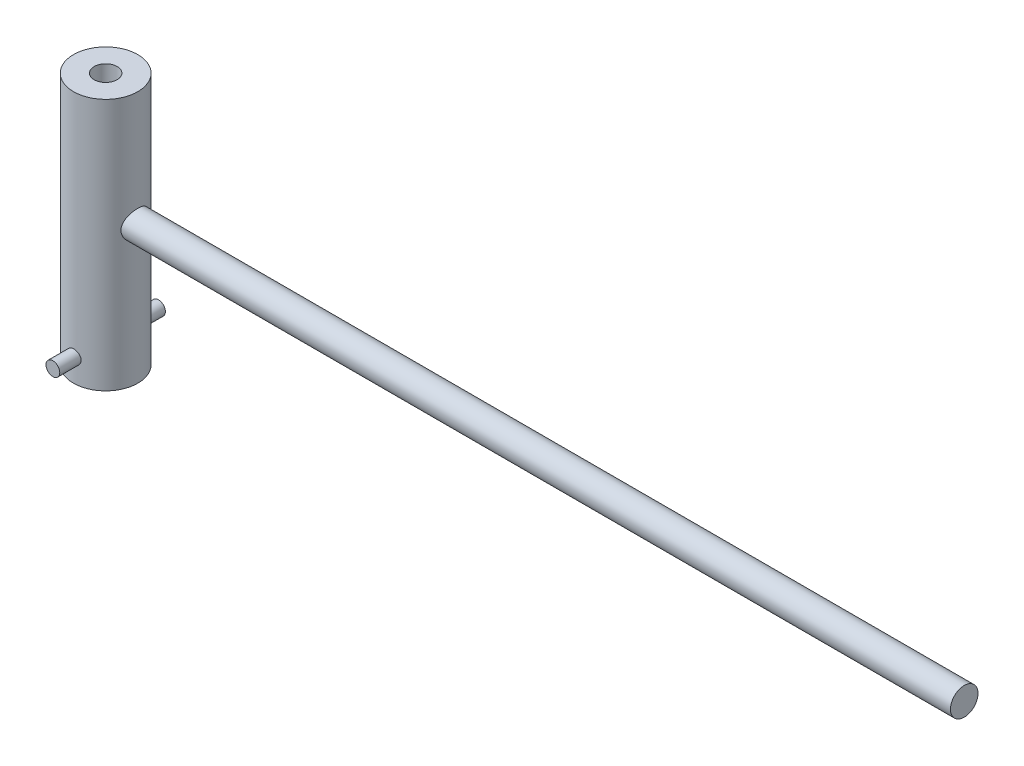
ISO-10303-21;
HEADER;
FILE_DESCRIPTION(('STEP AP214'),'2;1');
FILE_NAME('part.step','',(''),(''),'','','');
FILE_SCHEMA(('AUTOMOTIVE_DESIGN { 1 0 10303 214 1 1 1 1 }'));
ENDSEC;
DATA;
#1=APPLICATION_CONTEXT('core data for automotive mechanical design processes');
#2=APPLICATION_PROTOCOL_DEFINITION('international standard','automotive_design',2000,#1);
#3=PRODUCT_CONTEXT('',#1,'mechanical');
#4=PRODUCT('Part','Part','',(#3));
#5=PRODUCT_RELATED_PRODUCT_CATEGORY('part','',(#4));
#6=PRODUCT_DEFINITION_FORMATION('','',#4);
#7=PRODUCT_DEFINITION_CONTEXT('part definition',#1,'design');
#8=PRODUCT_DEFINITION('design','',#6,#7);
#9=PRODUCT_DEFINITION_SHAPE('','',#8);
#10=(LENGTH_UNIT() NAMED_UNIT(*) SI_UNIT(.MILLI.,.METRE.));
#11=(NAMED_UNIT(*) PLANE_ANGLE_UNIT() SI_UNIT($,.RADIAN.));
#12=(NAMED_UNIT(*) SI_UNIT($,.STERADIAN.) SOLID_ANGLE_UNIT());
#13=UNCERTAINTY_MEASURE_WITH_UNIT(LENGTH_MEASURE(1.E-05),#10,'distance_accuracy_value','');
#14=(GEOMETRIC_REPRESENTATION_CONTEXT(3) GLOBAL_UNCERTAINTY_ASSIGNED_CONTEXT((#13)) GLOBAL_UNIT_ASSIGNED_CONTEXT((#10,
#11,#12)) REPRESENTATION_CONTEXT('',''));
#15=CARTESIAN_POINT('',(0.,0.,0.));
#16=DIRECTION('',(0.,0.,1.));
#17=DIRECTION('',(1.,0.,0.));
#18=AXIS2_PLACEMENT_3D('',#15,#16,#17);
#19=CARTESIAN_POINT('',(-18.3586659492665,-25.,0.));
#20=DIRECTION('',(-1.,0.,0.));
#21=DIRECTION('',(0.,0.,1.));
#22=AXIS2_PLACEMENT_3D('',#19,#20,#21);
#23=CYLINDRICAL_SURFACE('',#22,3.);
#24=CARTESIAN_POINT('',(187.,-25.,0.));
#25=DIRECTION('',(1.,0.,0.));
#26=DIRECTION('',(0.,0.,-1.));
#27=AXIS2_PLACEMENT_3D('',#24,#25,#26);
#28=CIRCLE('',#27,3.);
#29=CARTESIAN_POINT('',(187.,-25.,-3.));
#30=VERTEX_POINT('',#29);
#31=EDGE_CURVE('E46',#30,#30,#28,.T.);
#32=ORIENTED_EDGE('',*,*,#31,.F.);
#33=EDGE_LOOP('',(#32));
#34=FACE_BOUND('',#33,.T.);
#35=CARTESIAN_POINT('',(6.32455532033676,-25.,3.));
#36=CARTESIAN_POINT('',(6.32455623917926,-24.9201992369691,2.99999904512121));
#37=CARTESIAN_POINT('',(6.32607259589376,-24.8403691800294,2.99680914186364));
#38=CARTESIAN_POINT('',(6.33207844610819,-24.6813131090452,2.98409481890062));
#39=CARTESIAN_POINT('',(6.33656983318199,-24.6020875122399,2.97456636476115));
#40=CARTESIAN_POINT('',(6.35433138320313,-24.3659109734567,2.93654933365816));
#41=CARTESIAN_POINT('',(6.3718883479981,-24.2106800341428,2.8986294210123));
#42=CARTESIAN_POINT('',(6.41604959211166,-23.9101296844014,2.79949691759116));
#43=CARTESIAN_POINT('',(6.4426154867075,-23.7647713124138,2.73838302089271));
#44=CARTESIAN_POINT('',(6.50173461776114,-23.4863744560023,2.59488993442855));
#45=CARTESIAN_POINT('',(6.53428667863443,-23.3533335603279,2.51251491871712));
#46=CARTESIAN_POINT('',(6.604111083221,-23.0945471604958,2.32303426891365));
#47=CARTESIAN_POINT('',(6.64154929418065,-22.9697137309487,2.21474428773221));
#48=CARTESIAN_POINT('',(6.71556787556132,-22.7392981429409,1.9789916252315));
#49=CARTESIAN_POINT('',(6.75214789882675,-22.6337236620024,1.85152133453084));
#50=CARTESIAN_POINT('',(6.82236442416005,-22.4400807595414,1.5737748906695));
#51=CARTESIAN_POINT('',(6.85578586283845,-22.3530507479227,1.42271545416052));
#52=CARTESIAN_POINT('',(6.91387422205065,-22.2060358333554,1.10640716164424));
#53=CARTESIAN_POINT('',(6.93854524147057,-22.1460382642549,0.941164994307303));
#54=CARTESIAN_POINT('',(6.9751747106229,-22.0581349636391,0.610764262051987));
#55=CARTESIAN_POINT('',(6.98775448299434,-22.0286539309609,0.446095117735235));
#56=CARTESIAN_POINT('',(7.00104925914407,-21.9975173032829,0.113699399968669));
#57=CARTESIAN_POINT('',(7.00176937203862,-21.995849726301,-0.0540258257506363));
#58=CARTESIAN_POINT('',(6.99162033228838,-22.0195902477911,-0.376268415183325));
#59=CARTESIAN_POINT('',(6.98149359551673,-22.0432637996837,-0.530941438169344));
#60=CARTESIAN_POINT('',(6.95182205628877,-22.1140240689202,-0.833871717827571));
#61=CARTESIAN_POINT('',(6.93227655784003,-22.1611125164986,-0.982128499493934));
#62=CARTESIAN_POINT('',(6.88526693329209,-22.2779065896527,-1.27075797068383));
#63=CARTESIAN_POINT('',(6.85768620781763,-22.3479472923291,-1.41097529460903));
#64=CARTESIAN_POINT('',(6.79727675004242,-22.5083173553763,-1.67803533028446));
#65=CARTESIAN_POINT('',(6.76444613359548,-22.5986540045407,-1.8048732130277));
#66=CARTESIAN_POINT('',(6.69393790301249,-22.804809506676,-2.05154784007322));
#67=CARTESIAN_POINT('',(6.6560813910746,-22.922018869774,-2.1701729768624));
#68=CARTESIAN_POINT('',(6.5815763134261,-23.1747028316495,-2.38662617777592));
#69=CARTESIAN_POINT('',(6.5449282748833,-23.3101852738067,-2.48444526456873));
#70=CARTESIAN_POINT('',(6.47566835431169,-23.6017798744715,-2.65987942757701));
#71=CARTESIAN_POINT('',(6.44325238173047,-23.7584641454813,-2.73662769389096));
#72=CARTESIAN_POINT('',(6.3884939447888,-24.0842890083433,-2.86214771894642));
#73=CARTESIAN_POINT('',(6.36614379619967,-24.253419983258,-2.9109408263676));
#74=CARTESIAN_POINT('',(6.33598550498636,-24.5871727956121,-2.97598670119679));
#75=CARTESIAN_POINT('',(6.32729797712828,-24.7513289806073,-2.99421280080632));
#76=CARTESIAN_POINT('',(6.32292988606606,-25.0805489751083,-3.00343131976711));
#77=CARTESIAN_POINT('',(6.32724437007431,-25.2456124151075,-2.99443410914467));
#78=CARTESIAN_POINT('',(6.34748143158176,-25.5598625737434,-2.9512647841786));
#79=CARTESIAN_POINT('',(6.36257694871081,-25.7093557403718,-2.9188846108295));
#80=CARTESIAN_POINT('',(6.40159573000742,-26.0006454763697,-2.83228012727602));
#81=CARTESIAN_POINT('',(6.42552113853309,-26.1424401665445,-2.77805051059372));
#82=CARTESIAN_POINT('',(6.4807666724858,-26.4212098902911,-2.64668378105435));
#83=CARTESIAN_POINT('',(6.51236308247385,-26.557707321822,-2.56865319415609));
#84=CARTESIAN_POINT('',(6.57901833984006,-26.8163507055113,-2.39277124314047));
#85=CARTESIAN_POINT('',(6.61407874120978,-26.9384901621981,-2.29491096228641));
#86=CARTESIAN_POINT('',(6.68739396565839,-27.1760289255727,-2.07211495440809));
#87=CARTESIAN_POINT('',(6.72566111015056,-27.2899152372238,-1.94556360485738));
#88=CARTESIAN_POINT('',(6.79826947497518,-27.4951342372748,-1.67428466903032));
#89=CARTESIAN_POINT('',(6.83261030191759,-27.5864646667921,-1.5295552644811));
#90=CARTESIAN_POINT('',(6.89381439172467,-27.7440826898071,-1.22458078741679));
#91=CARTESIAN_POINT('',(6.92064008929576,-27.8102450462872,-1.06426298143305));
#92=CARTESIAN_POINT('',(6.96347660484597,-27.9141497981562,-0.733319762769436));
#93=CARTESIAN_POINT('',(6.9794942735468,-27.9519101980084,-0.562700954301774));
#94=CARTESIAN_POINT('',(6.99808081286416,-27.9955774601566,-0.229480384595671));
#95=CARTESIAN_POINT('',(7.00154837158207,-28.0036138205194,-0.0672060876467152));
#96=CARTESIAN_POINT('',(6.99717401704727,-27.9934044812597,0.256339620951762));
#97=CARTESIAN_POINT('',(6.98933429595527,-27.975163875996,0.417611220908518));
#98=CARTESIAN_POINT('',(6.96371224258032,-27.9144464958275,0.728044798339692));
#99=CARTESIAN_POINT('',(6.94633102658131,-27.8729461526345,0.877433690400417));
#100=CARTESIAN_POINT('',(6.90358200259661,-27.7679838160802,1.16704890744754));
#101=CARTESIAN_POINT('',(6.87821272472254,-27.7045177805843,1.30727354037359));
#102=CARTESIAN_POINT('',(6.82048100144583,-27.554210112164,1.58164154030708));
#103=CARTESIAN_POINT('',(6.78785230171247,-27.4664340781465,1.71521554911027));
#104=CARTESIAN_POINT('',(6.71941601876115,-27.2713182864619,1.96631980223031));
#105=CARTESIAN_POINT('',(6.68360718068102,-27.1639707882705,2.08384366642575));
#106=CARTESIAN_POINT('',(6.60956029826529,-26.9236161365569,2.30839582375667));
#107=CARTESIAN_POINT('',(6.57133471854879,-26.789311585381,2.41404185093547));
#108=CARTESIAN_POINT('',(6.49938146624856,-26.5036538672722,2.60157161791913));
#109=CARTESIAN_POINT('',(6.46565641748318,-26.3522908492402,2.68344152863089));
#110=CARTESIAN_POINT('',(6.42172587804179,-26.1156175589237,2.78618250414778));
#111=CARTESIAN_POINT('',(6.40819457191418,-26.035144240841,2.81707998873811));
#112=CARTESIAN_POINT('',(6.38380411418014,-25.8714837771679,2.87192428390112));
#113=CARTESIAN_POINT('',(6.37294364206055,-25.7882979958088,2.89587453038153));
#114=CARTESIAN_POINT('',(6.35433014729515,-25.6200691923187,2.93649221837599));
#115=CARTESIAN_POINT('',(6.34656894419171,-25.535031692618,2.95317884271359));
#116=CARTESIAN_POINT('',(6.33442493706763,-25.3636372282871,2.97913893233313));
#117=CARTESIAN_POINT('',(6.33003954418515,-25.2772813266588,2.98841807850959));
#118=CARTESIAN_POINT('',(6.32647229512563,-25.1589385998236,2.99595579124565));
#119=CARTESIAN_POINT('',(6.32575401974705,-25.1271757192401,2.99747183035651));
#120=CARTESIAN_POINT('',(6.3247953454093,-25.0636101108314,2.99949413311608));
#121=CARTESIAN_POINT('',(6.32455495409998,-25.0318073823767,3.0000003806003));
#122=CARTESIAN_POINT('',(6.32455532033676,-25.,3.));
#123=B_SPLINE_CURVE_WITH_KNOTS('',3,(#35,#36,#37,#38,#39,#40,#41,#42,#43,#44,#45,#46,#47,#48,
#49,#50,#51,#52,#53,#54,#55,#56,#57,#58,#59,#60,#61,#62,#63,#64,#65,#66,#67,#68,#69,#70,#71,#72,
#73,#74,#75,#76,#77,#78,#79,#80,#81,#82,#83,#84,#85,#86,#87,#88,#89,#90,#91,#92,#93,#94,#95,#96,
#97,#98,#99,#100,#101,#102,#103,#104,#105,#106,#107,#108,#109,#110,#111,#112,#113,#114,#115,
#116,#117,#118,#119,#120,#121,#122),.UNSPECIFIED.,.T.,.F.,(4,2,2,2,2,2,2,2,2,2,2,2,2,2,2,2,2,2,
2,2,2,2,2,2,2,2,2,2,2,2,2,2,2,2,2,2,2,2,2,2,2,2,2,4),(0.,0.239366653231037,0.478885807272615,
0.95857439912593,1.43624431857919,1.91382053150697,2.41995684393642,2.92629448725105,
3.45610451675015,3.98566604296333,4.48627308722846,4.98666446539178,5.45487182502103,
5.92311378779297,6.39852111765621,6.87409945213909,7.38485137094337,7.89582322238326,
8.42542768080316,8.95462715213609,9.44812252419891,9.94142993544505,10.4004743903489,
10.8596303986217,11.3387499488479,11.8180854227975,12.3391595177845,12.8602857751477,
13.3839722669446,13.9073265049035,14.3923682623503,14.8773159966024,15.3432850585276,
15.8093399138768,16.2966585998759,16.7841704404229,17.3070906286303,17.8303143607245,
18.0917878499581,18.3531318004373,18.6137813055802,18.8742307225592,18.9696371385413,
19.0650450817536),.UNSPECIFIED.);
#124=CARTESIAN_POINT('',(6.32455532033676,-25.,3.));
#125=VERTEX_POINT('',#124);
#126=EDGE_CURVE('E10',#125,#125,#123,.T.);
#127=ORIENTED_EDGE('',*,*,#126,.F.);
#128=EDGE_LOOP('',(#127));
#129=FACE_BOUND('',#128,.T.);
#130=ADVANCED_FACE('F35',(#34,#129),#23,.T.);
#131=CARTESIAN_POINT('',(187.,-25.,0.));
#132=DIRECTION('',(1.,0.,0.));
#133=DIRECTION('',(0.,0.,-1.));
#134=AXIS2_PLACEMENT_3D('',#131,#132,#133);
#135=PLANE('',#134);
#136=ORIENTED_EDGE('',*,*,#31,.T.);
#137=EDGE_LOOP('',(#136));
#138=FACE_BOUND('',#137,.T.);
#139=ADVANCED_FACE('F70',(#138),#135,.T.);
#140=CARTESIAN_POINT('',(0.,0.,0.));
#141=DIRECTION('',(0.,1.,0.));
#142=DIRECTION('',(0.,0.,1.));
#143=AXIS2_PLACEMENT_3D('',#140,#141,#142);
#144=CYLINDRICAL_SURFACE('',#143,7.);
#145=CARTESIAN_POINT('',(1.5,-50.,6.83739716558868));
#146=CARTESIAN_POINT('',(1.49999708238613,-50.083211152482,6.83739884558951));
#147=CARTESIAN_POINT('',(1.49305236244768,-50.1664577739421,6.83893272341929));
#148=CARTESIAN_POINT('',(1.46548559252999,-50.330586672242,6.84489178429867));
#149=CARTESIAN_POINT('',(1.44485339653622,-50.4114671486762,6.84931911211842));
#150=CARTESIAN_POINT('',(1.39058863684599,-50.5684657495742,6.86054115293409));
#151=CARTESIAN_POINT('',(1.35697000991314,-50.6445888781215,6.86733332725825));
#152=CARTESIAN_POINT('',(1.27772617673341,-50.7901152739446,6.88251670848645));
#153=CARTESIAN_POINT('',(1.23210132048776,-50.8595187370291,6.89090786877545));
#154=CARTESIAN_POINT('',(1.12935142570221,-50.9907629614821,6.90849578796654));
#155=CARTESIAN_POINT('',(1.07206859483983,-51.05247887624,6.91770249871754));
#156=CARTESIAN_POINT('',(0.947969508129578,-51.1655035544058,6.93579691710397));
#157=CARTESIAN_POINT('',(0.881152530217677,-51.2168115288601,6.94468460051417));
#158=CARTESIAN_POINT('',(0.739047288464582,-51.3080554444914,6.96124769109432));
#159=CARTESIAN_POINT('',(0.663680488229954,-51.3478716557706,6.9689099881943));
#160=CARTESIAN_POINT('',(0.507134269342595,-51.4142276914463,6.98204671042934));
#161=CARTESIAN_POINT('',(0.425955477380312,-51.4407689447863,6.98752137103329));
#162=CARTESIAN_POINT('',(0.261387187671511,-51.4794299709313,6.99559565281181));
#163=CARTESIAN_POINT('',(0.178049400596923,-51.4917609285524,6.99823733378385));
#164=CARTESIAN_POINT('',(0.0104489453066432,-51.5023112773133,7.00049362207002));
#165=CARTESIAN_POINT('',(-0.0738136201647616,-51.5005322205608,7.00010856232699));
#166=CARTESIAN_POINT('',(-0.239417029250515,-51.4830710353364,6.99638700862558));
#167=CARTESIAN_POINT('',(-0.320783115362116,-51.4676164997101,6.99309883152432));
#168=CARTESIAN_POINT('',(-0.479739463978393,-51.4236053181481,6.98399541589105));
#169=CARTESIAN_POINT('',(-0.557329560175058,-51.3950480957003,6.97818006616519));
#170=CARTESIAN_POINT('',(-0.707167497556556,-51.3254385411115,6.96459754646858));
#171=CARTESIAN_POINT('',(-0.779373657015791,-51.2842992327957,6.95681685803946));
#172=CARTESIAN_POINT('',(-0.915940926562849,-51.1907580318364,6.94015793743865));
#173=CARTESIAN_POINT('',(-0.980301006451532,-51.1383546626997,6.93127956144694));
#174=CARTESIAN_POINT('',(-1.10070208800198,-51.0225314554721,6.91319326460925));
#175=CARTESIAN_POINT('',(-1.15655117320251,-50.958912420643,6.90398230372853));
#176=CARTESIAN_POINT('',(-1.25682243234728,-50.8231167149315,6.88643566831974));
#177=CARTESIAN_POINT('',(-1.30124432118069,-50.7509398305947,6.87810001563387));
#178=CARTESIAN_POINT('',(-1.37748077573297,-50.5997754989362,6.86324023586723));
#179=CARTESIAN_POINT('',(-1.40926035088923,-50.5207698761476,6.85672115127776));
#180=CARTESIAN_POINT('',(-1.45903495159116,-50.3583672340536,6.84630340806617));
#181=CARTESIAN_POINT('',(-1.47703206694628,-50.2749708825568,6.84240435218483));
#182=CARTESIAN_POINT('',(-1.49843586024652,-50.1079042473503,6.83774881255446));
#183=CARTESIAN_POINT('',(-1.5021214192864,-50.0242713249227,6.83693227051702));
#184=CARTESIAN_POINT('',(-1.49555139642374,-49.8575860068183,6.83837239573994));
#185=CARTESIAN_POINT('',(-1.48529673081635,-49.7745335733465,6.84062886101063));
#186=CARTESIAN_POINT('',(-1.45137894635584,-49.6123295650192,6.84790415484206));
#187=CARTESIAN_POINT('',(-1.42786830251554,-49.533144567403,6.85289155274364));
#188=CARTESIAN_POINT('',(-1.3682705294675,-49.3798376624671,6.86503859869777));
#189=CARTESIAN_POINT('',(-1.33218223662818,-49.3057162243658,6.87219844772849));
#190=CARTESIAN_POINT('',(-1.24783504416705,-49.1634303152411,6.88801634080346));
#191=CARTESIAN_POINT('',(-1.19940368590792,-49.0953704179878,6.89669501746317));
#192=CARTESIAN_POINT('',(-1.09197183833601,-48.9682416541262,6.91451775360139));
#193=CARTESIAN_POINT('',(-1.03297009182161,-48.9091738585515,6.92366186834462));
#194=CARTESIAN_POINT('',(-0.904812764420812,-48.8006296970552,6.94158239990174));
#195=CARTESIAN_POINT('',(-0.835494925828768,-48.751343083843,6.95034935607746));
#196=CARTESIAN_POINT('',(-0.689401481282273,-48.6651145906489,6.96635610714902));
#197=CARTESIAN_POINT('',(-0.612626216043736,-48.6281721470272,6.97359597176693));
#198=CARTESIAN_POINT('',(-0.454265418982036,-48.5679479453615,6.98569278381575));
#199=CARTESIAN_POINT('',(-0.372713193075168,-48.5445816962537,6.99056443803698));
#200=CARTESIAN_POINT('',(-0.206725177003286,-48.5119082942677,6.99743939301981));
#201=CARTESIAN_POINT('',(-0.12228978997399,-48.5025991840261,6.99944309312296));
#202=CARTESIAN_POINT('',(0.0452637170528315,-48.4983893475881,7.00034511009057));
#203=CARTESIAN_POINT('',(0.128374505509232,-48.5032048413954,6.99930459001668));
#204=CARTESIAN_POINT('',(0.292572938415963,-48.526474763519,6.99436552363383));
#205=CARTESIAN_POINT('',(0.373660616405288,-48.5449289655783,6.99046702473686));
#206=CARTESIAN_POINT('',(0.531301948487273,-48.5948188062495,6.98025388638537));
#207=CARTESIAN_POINT('',(0.607868365073182,-48.6262156893856,6.97394646430493));
#208=CARTESIAN_POINT('',(0.754684956723224,-48.7010612711691,6.95959036050661));
#209=CARTESIAN_POINT('',(0.824934544796144,-48.744511088306,6.95154151720341));
#210=CARTESIAN_POINT('',(0.958512306895247,-48.8431623187427,6.93439809934494));
#211=CARTESIAN_POINT('',(1.02169036510578,-48.8985641583213,6.92528708907874));
#212=CARTESIAN_POINT('',(1.13795001457643,-49.0191406102504,6.90713690075836));
#213=CARTESIAN_POINT('',(1.19102918062422,-49.0843175633556,6.89809774045682));
#214=CARTESIAN_POINT('',(1.28623261596675,-49.2235904931857,6.88098693651916));
#215=CARTESIAN_POINT('',(1.32820897809617,-49.297789358287,6.87292905956534));
#216=CARTESIAN_POINT('',(1.39903004659825,-49.4523437209233,6.85886497228049));
#217=CARTESIAN_POINT('',(1.42788606423931,-49.5326938452531,6.85285699581573));
#218=CARTESIAN_POINT('',(1.46638607121558,-49.6776261311859,6.84470560641997));
#219=CARTESIAN_POINT('',(1.47896752507744,-49.7414116757078,6.84198283087953));
#220=CARTESIAN_POINT('',(1.49577544043437,-49.8701243115773,6.83832799504406));
#221=CARTESIAN_POINT('',(1.50000227727981,-49.9350513515083,6.8373958543007));
#222=CARTESIAN_POINT('',(1.5,-50.,6.83739716558868));
#223=B_SPLINE_CURVE_WITH_KNOTS('',3,(#145,#146,#147,#148,#149,#150,#151,#152,#153,#154,#155,
#156,#157,#158,#159,#160,#161,#162,#163,#164,#165,#166,#167,#168,#169,#170,#171,#172,#173,#174,
#175,#176,#177,#178,#179,#180,#181,#182,#183,#184,#185,#186,#187,#188,#189,#190,#191,#192,#193,
#194,#195,#196,#197,#198,#199,#200,#201,#202,#203,#204,#205,#206,#207,#208,#209,#210,#211,#212,
#213,#214,#215,#216,#217,#218,#219,#220,#221,#222),.UNSPECIFIED.,.T.,.F.,(4,2,2,2,2,2,2,2,2,2,2,
2,2,2,2,2,2,2,2,2,2,2,2,2,2,2,2,2,2,2,2,2,2,2,2,2,2,2,4),(0.,0.249395482027527,
0.498976038479968,0.748289491152764,0.997595676735284,1.25053229582692,1.50348808112879,
1.75899134820279,2.01446710646268,2.26609508151929,2.51769537777242,2.76518557667372,
3.01268666607584,3.26193888143438,3.51122378872316,3.76548960779296,4.01976177023093,
4.27473287411782,4.52966530953839,4.77960433192523,5.02952692653917,5.27663180749375,
5.52375955563151,5.77455010216318,6.02537049659079,6.28066214683211,6.53594213875543,
6.78961589824377,7.0432543320854,7.29183199644128,7.54040553715101,7.78824009619485,
8.03609766151367,8.28848914160966,8.54094115631234,8.7966038016725,9.05204561611689,
9.24671456122273,9.44137476018023),.UNSPECIFIED.);
#224=CARTESIAN_POINT('',(1.5,-50.,6.83739716558868));
#225=VERTEX_POINT('',#224);
#226=EDGE_CURVE('E50',#225,#225,#223,.T.);
#227=ORIENTED_EDGE('',*,*,#226,.T.);
#228=EDGE_LOOP('',(#227));
#229=FACE_BOUND('',#228,.T.);
#230=CARTESIAN_POINT('',(0.,-55.,0.));
#231=DIRECTION('',(0.,1.,0.));
#232=DIRECTION('',(0.,0.,1.));
#233=AXIS2_PLACEMENT_3D('',#230,#231,#232);
#234=CIRCLE('',#233,7.00000000000001);
#235=CARTESIAN_POINT('',(0.,-55.,7.00000000000001));
#236=VERTEX_POINT('',#235);
#237=EDGE_CURVE('E191',#236,#236,#234,.T.);
#238=ORIENTED_EDGE('',*,*,#237,.T.);
#239=EDGE_LOOP('',(#238));
#240=FACE_BOUND('',#239,.T.);
#241=CARTESIAN_POINT('',(0.,0.,0.));
#242=DIRECTION('',(0.,1.,0.));
#243=DIRECTION('',(0.,0.,1.));
#244=AXIS2_PLACEMENT_3D('',#241,#242,#243);
#245=CIRCLE('',#244,7.);
#246=CARTESIAN_POINT('',(0.,0.,7.));
#247=VERTEX_POINT('',#246);
#248=EDGE_CURVE('E193',#247,#247,#245,.T.);
#249=ORIENTED_EDGE('',*,*,#248,.F.);
#250=EDGE_LOOP('',(#249));
#251=FACE_BOUND('',#250,.T.);
#252=CARTESIAN_POINT('',(-1.5,-50.,-6.83739716558868));
#253=CARTESIAN_POINT('',(-1.49999708238613,-50.0832111524819,-6.83739884558951));
#254=CARTESIAN_POINT('',(-1.49305236244768,-50.1664577739421,-6.83893272341929));
#255=CARTESIAN_POINT('',(-1.46548559253,-50.330586672242,-6.84489178429867));
#256=CARTESIAN_POINT('',(-1.44485339653622,-50.4114671486762,-6.84931911211842));
#257=CARTESIAN_POINT('',(-1.390588636846,-50.5684657495742,-6.86054115293409));
#258=CARTESIAN_POINT('',(-1.35697000991315,-50.6445888781215,-6.86733332725825));
#259=CARTESIAN_POINT('',(-1.27772617673341,-50.7901152739446,-6.88251670848644));
#260=CARTESIAN_POINT('',(-1.23210132048776,-50.8595187370291,-6.89090786877545));
#261=CARTESIAN_POINT('',(-1.12935142570221,-50.9907629614821,-6.90849578796654));
#262=CARTESIAN_POINT('',(-1.07206859483983,-51.05247887624,-6.91770249871754));
#263=CARTESIAN_POINT('',(-0.94796950812958,-51.1655035544058,-6.93579691710397));
#264=CARTESIAN_POINT('',(-0.881152530217679,-51.2168115288601,-6.94468460051417));
#265=CARTESIAN_POINT('',(-0.739047288464585,-51.3080554444914,-6.96124769109432));
#266=CARTESIAN_POINT('',(-0.663680488229956,-51.3478716557706,-6.9689099881943));
#267=CARTESIAN_POINT('',(-0.507134269342598,-51.4142276914463,-6.98204671042934));
#268=CARTESIAN_POINT('',(-0.425955477380316,-51.4407689447863,-6.98752137103329));
#269=CARTESIAN_POINT('',(-0.261387187671517,-51.4794299709313,-6.99559565281181));
#270=CARTESIAN_POINT('',(-0.178049400596928,-51.4917609285524,-6.99823733378385));
#271=CARTESIAN_POINT('',(-0.0104489453066492,-51.5023112773133,-7.00049362207002));
#272=CARTESIAN_POINT('',(0.073813620164755,-51.5005322205608,-7.00010856232699));
#273=CARTESIAN_POINT('',(0.239417029250508,-51.4830710353364,-6.99638700862558));
#274=CARTESIAN_POINT('',(0.32078311536211,-51.4676164997101,-6.99309883152432));
#275=CARTESIAN_POINT('',(0.479739463978386,-51.4236053181481,-6.98399541589105));
#276=CARTESIAN_POINT('',(0.557329560175051,-51.3950480957003,-6.97818006616519));
#277=CARTESIAN_POINT('',(0.707167497556549,-51.3254385411115,-6.96459754646858));
#278=CARTESIAN_POINT('',(0.779373657015785,-51.2842992327957,-6.95681685803946));
#279=CARTESIAN_POINT('',(0.915940926562842,-51.1907580318364,-6.94015793743865));
#280=CARTESIAN_POINT('',(0.980301006451525,-51.1383546626997,-6.93127956144694));
#281=CARTESIAN_POINT('',(1.10070208800198,-51.0225314554721,-6.91319326460925));
#282=CARTESIAN_POINT('',(1.1565511732025,-50.958912420643,-6.90398230372853));
#283=CARTESIAN_POINT('',(1.25682243234728,-50.8231167149315,-6.88643566831975));
#284=CARTESIAN_POINT('',(1.30124432118068,-50.7509398305948,-6.87810001563387));
#285=CARTESIAN_POINT('',(1.37748077573296,-50.5997754989362,-6.86324023586723));
#286=CARTESIAN_POINT('',(1.40926035088922,-50.5207698761476,-6.85672115127776));
#287=CARTESIAN_POINT('',(1.45903495159115,-50.3583672340536,-6.84630340806617));
#288=CARTESIAN_POINT('',(1.47703206694628,-50.2749708825568,-6.84240435218483));
#289=CARTESIAN_POINT('',(1.49843586024652,-50.1079042473503,-6.83774881255446));
#290=CARTESIAN_POINT('',(1.5021214192864,-50.0242713249227,-6.83693227051702));
#291=CARTESIAN_POINT('',(1.49555139642373,-49.8575860068183,-6.83837239573994));
#292=CARTESIAN_POINT('',(1.48529673081635,-49.7745335733465,-6.84062886101063));
#293=CARTESIAN_POINT('',(1.45137894635584,-49.6123295650192,-6.84790415484206));
#294=CARTESIAN_POINT('',(1.42786830251553,-49.533144567403,-6.85289155274364));
#295=CARTESIAN_POINT('',(1.3682705294675,-49.3798376624671,-6.86503859869777));
#296=CARTESIAN_POINT('',(1.33218223662818,-49.3057162243658,-6.87219844772849));
#297=CARTESIAN_POINT('',(1.24783504416705,-49.1634303152411,-6.88801634080346));
#298=CARTESIAN_POINT('',(1.19940368590792,-49.0953704179878,-6.89669501746317));
#299=CARTESIAN_POINT('',(1.09197183833601,-48.9682416541262,-6.91451775360139));
#300=CARTESIAN_POINT('',(1.03297009182161,-48.9091738585515,-6.92366186834462));
#301=CARTESIAN_POINT('',(0.904812764420818,-48.8006296970552,-6.94158239990174));
#302=CARTESIAN_POINT('',(0.835494925828774,-48.751343083843,-6.95034935607746));
#303=CARTESIAN_POINT('',(0.68940148128228,-48.665114590649,-6.96635610714901));
#304=CARTESIAN_POINT('',(0.612626216043743,-48.6281721470272,-6.97359597176692));
#305=CARTESIAN_POINT('',(0.454265418982044,-48.5679479453615,-6.98569278381575));
#306=CARTESIAN_POINT('',(0.372713193075176,-48.5445816962537,-6.99056443803698));
#307=CARTESIAN_POINT('',(0.206725177003294,-48.5119082942677,-6.99743939301981));
#308=CARTESIAN_POINT('',(0.122289789973998,-48.5025991840261,-6.99944309312296));
#309=CARTESIAN_POINT('',(-0.0452637170528241,-48.4983893475882,-7.00034511009057));
#310=CARTESIAN_POINT('',(-0.128374505509225,-48.5032048413954,-6.99930459001668));
#311=CARTESIAN_POINT('',(-0.292572938415957,-48.526474763519,-6.99436552363383));
#312=CARTESIAN_POINT('',(-0.373660616405281,-48.5449289655783,-6.99046702473686));
#313=CARTESIAN_POINT('',(-0.531301948487266,-48.5948188062495,-6.98025388638537));
#314=CARTESIAN_POINT('',(-0.607868365073175,-48.6262156893856,-6.97394646430493));
#315=CARTESIAN_POINT('',(-0.754684956723219,-48.7010612711691,-6.95959036050661));
#316=CARTESIAN_POINT('',(-0.824934544796139,-48.744511088306,-6.95154151720341));
#317=CARTESIAN_POINT('',(-0.958512306895243,-48.8431623187427,-6.93439809934494));
#318=CARTESIAN_POINT('',(-1.02169036510578,-48.8985641583213,-6.92528708907874));
#319=CARTESIAN_POINT('',(-1.13795001457643,-49.0191406102504,-6.90713690075837));
#320=CARTESIAN_POINT('',(-1.19102918062422,-49.0843175633556,-6.89809774045682));
#321=CARTESIAN_POINT('',(-1.28623261596675,-49.2235904931857,-6.88098693651916));
#322=CARTESIAN_POINT('',(-1.32820897809616,-49.297789358287,-6.87292905956534));
#323=CARTESIAN_POINT('',(-1.39903004659825,-49.4523437209233,-6.85886497228049));
#324=CARTESIAN_POINT('',(-1.4278860642393,-49.5326938452531,-6.85285699581573));
#325=CARTESIAN_POINT('',(-1.46638607121557,-49.6776261311859,-6.84470560641997));
#326=CARTESIAN_POINT('',(-1.47896752507743,-49.7414116757078,-6.84198283087953));
#327=CARTESIAN_POINT('',(-1.49577544043437,-49.8701243115773,-6.83832799504406));
#328=CARTESIAN_POINT('',(-1.50000227727981,-49.9350513515083,-6.8373958543007));
#329=CARTESIAN_POINT('',(-1.5,-50.,-6.83739716558868));
#330=B_SPLINE_CURVE_WITH_KNOTS('',3,(#252,#253,#254,#255,#256,#257,#258,#259,#260,#261,#262,
#263,#264,#265,#266,#267,#268,#269,#270,#271,#272,#273,#274,#275,#276,#277,#278,#279,#280,#281,
#282,#283,#284,#285,#286,#287,#288,#289,#290,#291,#292,#293,#294,#295,#296,#297,#298,#299,#300,
#301,#302,#303,#304,#305,#306,#307,#308,#309,#310,#311,#312,#313,#314,#315,#316,#317,#318,#319,
#320,#321,#322,#323,#324,#325,#326,#327,#328,#329),.UNSPECIFIED.,.T.,.F.,(4,2,2,2,2,2,2,2,2,2,2,
2,2,2,2,2,2,2,2,2,2,2,2,2,2,2,2,2,2,2,2,2,2,2,2,2,2,2,4),(0.,0.249395482027513,0.49897603847996,
0.748289491152749,0.997595676735275,1.25053229582692,1.50348808112878,1.75899134820278,
2.01446710646267,2.26609508151928,2.5176953777724,2.76518557667371,3.01268666607583,
3.26193888143437,3.51122378872314,3.76548960779295,4.01976177023092,4.2747328741178,
4.52966530953838,4.77960433192523,5.02952692653917,5.27663180749374,5.52375955563149,
5.77455010216318,6.02537049659078,6.2806621468321,6.53594213875541,6.78961589824375,
7.04325433208538,7.29183199644126,7.54040553715099,7.78824009619483,8.03609766151365,
8.28848914160965,8.54094115631232,8.79660380167249,9.05204561611687,9.24671456122271,
9.44137476018022),.UNSPECIFIED.);
#331=CARTESIAN_POINT('',(-1.5,-50.,-6.83739716558868));
#332=VERTEX_POINT('',#331);
#333=EDGE_CURVE('E78',#332,#332,#330,.T.);
#334=ORIENTED_EDGE('',*,*,#333,.T.);
#335=EDGE_LOOP('',(#334));
#336=FACE_BOUND('',#335,.T.);
#337=ORIENTED_EDGE('',*,*,#126,.T.);
#338=EDGE_LOOP('',(#337));
#339=FACE_BOUND('',#338,.T.);
#340=ADVANCED_FACE('F65',(#229,#240,#251,#336,#339),#144,.T.);
#341=CARTESIAN_POINT('',(0.,-50.,15.1195553164222));
#342=DIRECTION('',(0.,0.,1.));
#343=DIRECTION('',(1.,0.,0.));
#344=AXIS2_PLACEMENT_3D('',#341,#342,#343);
#345=CYLINDRICAL_SURFACE('',#344,1.5);
#346=CARTESIAN_POINT('',(0.,-50.,11.5));
#347=DIRECTION('',(0.,0.,1.));
#348=DIRECTION('',(1.,0.,0.));
#349=AXIS2_PLACEMENT_3D('',#346,#347,#348);
#350=CIRCLE('',#349,1.5);
#351=CARTESIAN_POINT('',(1.5,-50.,11.5));
#352=VERTEX_POINT('',#351);
#353=EDGE_CURVE('E54',#352,#352,#350,.T.);
#354=ORIENTED_EDGE('',*,*,#353,.F.);
#355=EDGE_LOOP('',(#354));
#356=FACE_BOUND('',#355,.T.);
#357=ORIENTED_EDGE('',*,*,#226,.F.);
#358=EDGE_LOOP('',(#357));
#359=FACE_BOUND('',#358,.T.);
#360=ADVANCED_FACE('F62',(#356,#359),#345,.T.);
#361=CARTESIAN_POINT('',(0.,-50.,11.5));
#362=DIRECTION('',(0.,0.,1.));
#363=DIRECTION('',(1.,0.,0.));
#364=AXIS2_PLACEMENT_3D('',#361,#362,#363);
#365=PLANE('',#364);
#366=ORIENTED_EDGE('',*,*,#353,.T.);
#367=EDGE_LOOP('',(#366));
#368=FACE_BOUND('',#367,.T.);
#369=ADVANCED_FACE('F130',(#368),#365,.T.);
#370=CARTESIAN_POINT('',(0.,0.,0.));
#371=DIRECTION('',(0.,-1.,0.));
#372=DIRECTION('',(0.,0.,-1.));
#373=AXIS2_PLACEMENT_3D('',#370,#371,#372);
#374=PLANE('',#373);
#375=CARTESIAN_POINT('',(0.,0.,0.));
#376=DIRECTION('',(0.,1.,0.));
#377=DIRECTION('',(0.,0.,1.));
#378=AXIS2_PLACEMENT_3D('',#375,#376,#377);
#379=CIRCLE('',#378,2.5);
#380=CARTESIAN_POINT('',(0.,0.,2.5));
#381=VERTEX_POINT('',#380);
#382=EDGE_CURVE('E86',#381,#381,#379,.T.);
#383=ORIENTED_EDGE('',*,*,#382,.F.);
#384=EDGE_LOOP('',(#383));
#385=FACE_BOUND('',#384,.T.);
#386=ORIENTED_EDGE('',*,*,#248,.T.);
#387=EDGE_LOOP('',(#386));
#388=FACE_BOUND('',#387,.T.);
#389=ADVANCED_FACE('F74',(#385,#388),#374,.F.);
#390=CARTESIAN_POINT('',(7.00000000000001,-55.,0.));
#391=DIRECTION('',(0.,1.,0.));
#392=DIRECTION('',(0.,0.,1.));
#393=AXIS2_PLACEMENT_3D('',#390,#391,#392);
#394=PLANE('',#393);
#395=CARTESIAN_POINT('',(0.,-55.,0.));
#396=DIRECTION('',(0.,1.,0.));
#397=DIRECTION('',(0.,0.,1.));
#398=AXIS2_PLACEMENT_3D('',#395,#396,#397);
#399=CIRCLE('',#398,2.5);
#400=CARTESIAN_POINT('',(0.,-55.,2.5));
#401=VERTEX_POINT('',#400);
#402=EDGE_CURVE('E88',#401,#401,#399,.T.);
#403=ORIENTED_EDGE('',*,*,#402,.T.);
#404=EDGE_LOOP('',(#403));
#405=FACE_BOUND('',#404,.T.);
#406=ORIENTED_EDGE('',*,*,#237,.F.);
#407=EDGE_LOOP('',(#406));
#408=FACE_BOUND('',#407,.T.);
#409=ADVANCED_FACE('F72',(#405,#408),#394,.F.);
#410=CARTESIAN_POINT('',(0.,-55.,0.));
#411=DIRECTION('',(0.,1.,0.));
#412=DIRECTION('',(0.,0.,1.));
#413=AXIS2_PLACEMENT_3D('',#410,#411,#412);
#414=CYLINDRICAL_SURFACE('',#413,2.5);
#415=ORIENTED_EDGE('',*,*,#402,.F.);
#416=EDGE_LOOP('',(#415));
#417=FACE_BOUND('',#416,.T.);
#418=ORIENTED_EDGE('',*,*,#382,.T.);
#419=EDGE_LOOP('',(#418));
#420=FACE_BOUND('',#419,.T.);
#421=ADVANCED_FACE('F94',(#417,#420),#414,.F.);
#422=CARTESIAN_POINT('',(0.,-50.,17.9731062549823));
#423=DIRECTION('',(0.,0.,1.));
#424=DIRECTION('',(1.,0.,0.));
#425=AXIS2_PLACEMENT_3D('',#422,#423,#424);
#426=CYLINDRICAL_SURFACE('',#425,1.5);
#427=ORIENTED_EDGE('',*,*,#333,.F.);
#428=EDGE_LOOP('',(#427));
#429=FACE_BOUND('',#428,.T.);
#430=CARTESIAN_POINT('',(0.,-50.,-11.5));
#431=DIRECTION('',(0.,0.,-1.));
#432=DIRECTION('',(-1.,0.,0.));
#433=AXIS2_PLACEMENT_3D('',#430,#431,#432);
#434=CIRCLE('',#433,1.5);
#435=CARTESIAN_POINT('',(-1.5,-50.,-11.5));
#436=VERTEX_POINT('',#435);
#437=EDGE_CURVE('E87',#436,#436,#434,.T.);
#438=ORIENTED_EDGE('',*,*,#437,.F.);
#439=EDGE_LOOP('',(#438));
#440=FACE_BOUND('',#439,.T.);
#441=ADVANCED_FACE('F96',(#429,#440),#426,.T.);
#442=CARTESIAN_POINT('',(0.,-50.,-11.5));
#443=DIRECTION('',(0.,0.,-1.));
#444=DIRECTION('',(-1.,0.,0.));
#445=AXIS2_PLACEMENT_3D('',#442,#443,#444);
#446=PLANE('',#445);
#447=ORIENTED_EDGE('',*,*,#437,.T.);
#448=EDGE_LOOP('',(#447));
#449=FACE_BOUND('',#448,.T.);
#450=ADVANCED_FACE('F93',(#449),#446,.T.);
#451=CLOSED_SHELL('',(#130,#139,#340,#360,#369,#389,#409,#421,#441,#450));
#452=MANIFOLD_SOLID_BREP('B2',#451);
#453=ADVANCED_BREP_SHAPE_REPRESENTATION('',(#18,#452),#14);
#454=SHAPE_DEFINITION_REPRESENTATION(#9,#453);
ENDSEC;
END-ISO-10303-21;
